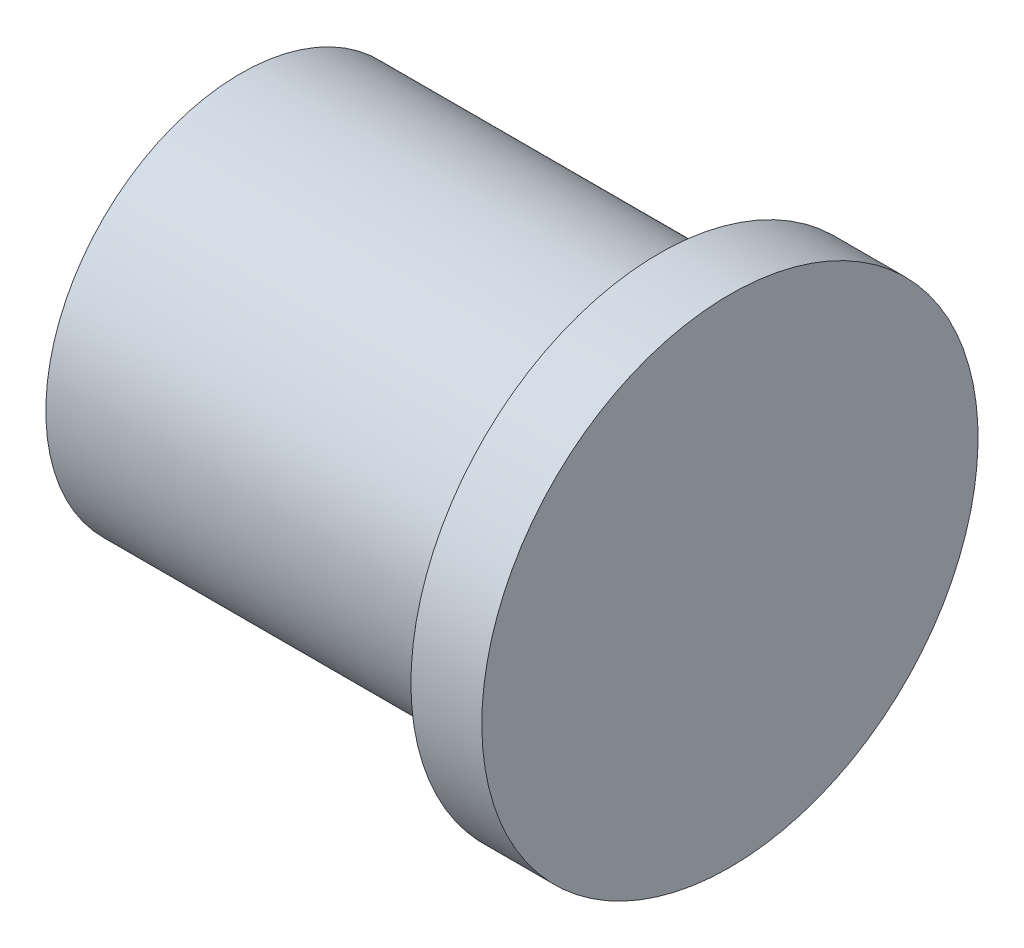
ISO-10303-21;
HEADER;
FILE_DESCRIPTION(('STEP AP214'),'2;1');
FILE_NAME('part.step','',(''),(''),'','','');
FILE_SCHEMA(('AUTOMOTIVE_DESIGN { 1 0 10303 214 1 1 1 1 }'));
ENDSEC;
DATA;
#1=APPLICATION_CONTEXT('core data for automotive mechanical design processes');
#2=APPLICATION_PROTOCOL_DEFINITION('international standard','automotive_design',2000,#1);
#3=PRODUCT_CONTEXT('',#1,'mechanical');
#4=PRODUCT('Part','Part','',(#3));
#5=PRODUCT_RELATED_PRODUCT_CATEGORY('part','',(#4));
#6=PRODUCT_DEFINITION_FORMATION('','',#4);
#7=PRODUCT_DEFINITION_CONTEXT('part definition',#1,'design');
#8=PRODUCT_DEFINITION('design','',#6,#7);
#9=PRODUCT_DEFINITION_SHAPE('','',#8);
#10=(LENGTH_UNIT() NAMED_UNIT(*) SI_UNIT(.MILLI.,.METRE.));
#11=(NAMED_UNIT(*) PLANE_ANGLE_UNIT() SI_UNIT($,.RADIAN.));
#12=(NAMED_UNIT(*) SI_UNIT($,.STERADIAN.) SOLID_ANGLE_UNIT());
#13=UNCERTAINTY_MEASURE_WITH_UNIT(LENGTH_MEASURE(1.E-05),#10,'distance_accuracy_value','');
#14=(GEOMETRIC_REPRESENTATION_CONTEXT(3) GLOBAL_UNCERTAINTY_ASSIGNED_CONTEXT((#13)) GLOBAL_UNIT_ASSIGNED_CONTEXT((#10,
#11,#12)) REPRESENTATION_CONTEXT('',''));
#15=CARTESIAN_POINT('',(0.,0.,0.));
#16=DIRECTION('',(0.,0.,1.));
#17=DIRECTION('',(1.,0.,0.));
#18=AXIS2_PLACEMENT_3D('',#15,#16,#17);
#19=CARTESIAN_POINT('',(421.699986332778,29.1316832556016,53.5784142556047));
#20=DIRECTION('',(0.999999999998964,1.43736448304796E-06,-8.34688984987295E-08));
#21=DIRECTION('',(-1.43736448304796E-06,0.999999999998967,0.));
#22=AXIS2_PLACEMENT_3D('',#19,#20,#21);
#23=CYLINDRICAL_SURFACE('',#22,5.5);
#24=CARTESIAN_POINT('',(421.699986332778,29.1316832556016,53.5784142556047));
#25=DIRECTION('',(-0.999999999998963,-1.43736448304795E-06,8.34688984987295E-08));
#26=DIRECTION('',(-8.34688984986436E-08,-1.19791533121337E-13,-1.));
#27=AXIS2_PLACEMENT_3D('',#24,#25,#26);
#28=CIRCLE('',#27,5.5);
#29=CARTESIAN_POINT('',(421.699985873699,29.1316832556009,48.0784142556047));
#30=VERTEX_POINT('',#29);
#31=EDGE_CURVE('E10',#30,#30,#28,.T.);
#32=ORIENTED_EDGE('',*,*,#31,.F.);
#33=EDGE_LOOP('',(#32));
#34=FACE_BOUND('',#33,.T.);
#35=CARTESIAN_POINT('',(433.499986332766,29.1317002165024,53.5784132706717));
#36=DIRECTION('',(-0.999999999998963,-1.43736448304795E-06,8.34688984987295E-08));
#37=DIRECTION('',(-8.34688984986436E-08,-1.19791533121337E-13,-1.));
#38=AXIS2_PLACEMENT_3D('',#35,#36,#37);
#39=CIRCLE('',#38,5.5);
#40=CARTESIAN_POINT('',(433.499985873687,29.1317002165018,48.0784132706717));
#41=VERTEX_POINT('',#40);
#42=EDGE_CURVE('E18',#41,#41,#39,.T.);
#43=ORIENTED_EDGE('',*,*,#42,.T.);
#44=EDGE_LOOP('',(#43));
#45=FACE_BOUND('',#44,.T.);
#46=ADVANCED_FACE('F15',(#34,#45),#23,.T.);
#47=CARTESIAN_POINT('',(421.699986332778,29.1316832556016,53.5784142556047));
#48=DIRECTION('',(-0.999999999998963,-1.43736448304795E-06,8.34688984987295E-08));
#49=DIRECTION('',(1.43736448304796E-06,-0.999999999998967,0.));
#50=AXIS2_PLACEMENT_3D('',#47,#48,#49);
#51=PLANE('',#50);
#52=ORIENTED_EDGE('',*,*,#31,.T.);
#53=EDGE_LOOP('',(#52));
#54=FACE_BOUND('',#53,.T.);
#55=ADVANCED_FACE('F38',(#54),#51,.T.);
#56=CARTESIAN_POINT('',(435.499986332764,29.1317030912315,53.5784131037339));
#57=DIRECTION('',(-0.999999999998963,-1.43736448304796E-06,8.34688984987295E-08));
#58=DIRECTION('',(1.43736448304796E-06,-0.999999999998967,0.));
#59=AXIS2_PLACEMENT_3D('',#56,#57,#58);
#60=CYLINDRICAL_SURFACE('',#59,7.);
#61=CARTESIAN_POINT('',(435.499986332764,29.1317030912315,53.5784131037339));
#62=DIRECTION('',(0.999999999998963,1.43736448304796E-06,-8.34688984987293E-08));
#63=DIRECTION('',(0.,0.0579731284602767,0.99831814386824));
#64=AXIS2_PLACEMENT_3D('',#61,#62,#63);
#65=CIRCLE('',#64,7.);
#66=CARTESIAN_POINT('',(435.499986332764,29.5375149904534,60.5666401108116));
#67=VERTEX_POINT('',#66);
#68=EDGE_CURVE('E25',#67,#67,#65,.T.);
#69=ORIENTED_EDGE('',*,*,#68,.F.);
#70=EDGE_LOOP('',(#69));
#71=FACE_BOUND('',#70,.T.);
#72=CARTESIAN_POINT('',(433.499986332766,29.1317002165025,53.5784132706717));
#73=DIRECTION('',(0.999999999998963,1.43736448304796E-06,-8.34688984987293E-08));
#74=DIRECTION('',(0.,0.0579731284602767,0.99831814386824));
#75=AXIS2_PLACEMENT_3D('',#72,#73,#74);
#76=CIRCLE('',#75,7.);
#77=CARTESIAN_POINT('',(433.499986332766,29.5375121157244,60.5666402777494));
#78=VERTEX_POINT('',#77);
#79=EDGE_CURVE('E27',#78,#78,#76,.T.);
#80=ORIENTED_EDGE('',*,*,#79,.T.);
#81=EDGE_LOOP('',(#80));
#82=FACE_BOUND('',#81,.T.);
#83=ADVANCED_FACE('F35',(#71,#82),#60,.T.);
#84=CARTESIAN_POINT('',(435.499986332764,29.1317030912315,53.5784131037339));
#85=DIRECTION('',(0.999999999998963,1.43736448304796E-06,-8.34688984987293E-08));
#86=DIRECTION('',(-1.43736448304796E-06,0.999999999998967,0.));
#87=AXIS2_PLACEMENT_3D('',#84,#85,#86);
#88=PLANE('',#87);
#89=ORIENTED_EDGE('',*,*,#68,.T.);
#90=EDGE_LOOP('',(#89));
#91=FACE_BOUND('',#90,.T.);
#92=ADVANCED_FACE('F33',(#91),#88,.T.);
#93=CARTESIAN_POINT('',(433.499986332766,29.1317002165025,53.5784132706717));
#94=DIRECTION('',(0.999999999998963,1.43736448304796E-06,-8.34688984987293E-08));
#95=DIRECTION('',(-1.43736448304796E-06,0.999999999998967,0.));
#96=AXIS2_PLACEMENT_3D('',#93,#94,#95);
#97=PLANE('',#96);
#98=ORIENTED_EDGE('',*,*,#42,.F.);
#99=EDGE_LOOP('',(#98));
#100=FACE_BOUND('',#99,.T.);
#101=ORIENTED_EDGE('',*,*,#79,.F.);
#102=EDGE_LOOP('',(#101));
#103=FACE_BOUND('',#102,.T.);
#104=ADVANCED_FACE('F42',(#100,#103),#97,.F.);
#105=CLOSED_SHELL('',(#46,#55,#83,#92,#104));
#106=MANIFOLD_SOLID_BREP('B1',#105);
#107=ADVANCED_BREP_SHAPE_REPRESENTATION('',(#18,#106),#14);
#108=SHAPE_DEFINITION_REPRESENTATION(#9,#107);
ENDSEC;
END-ISO-10303-21;
